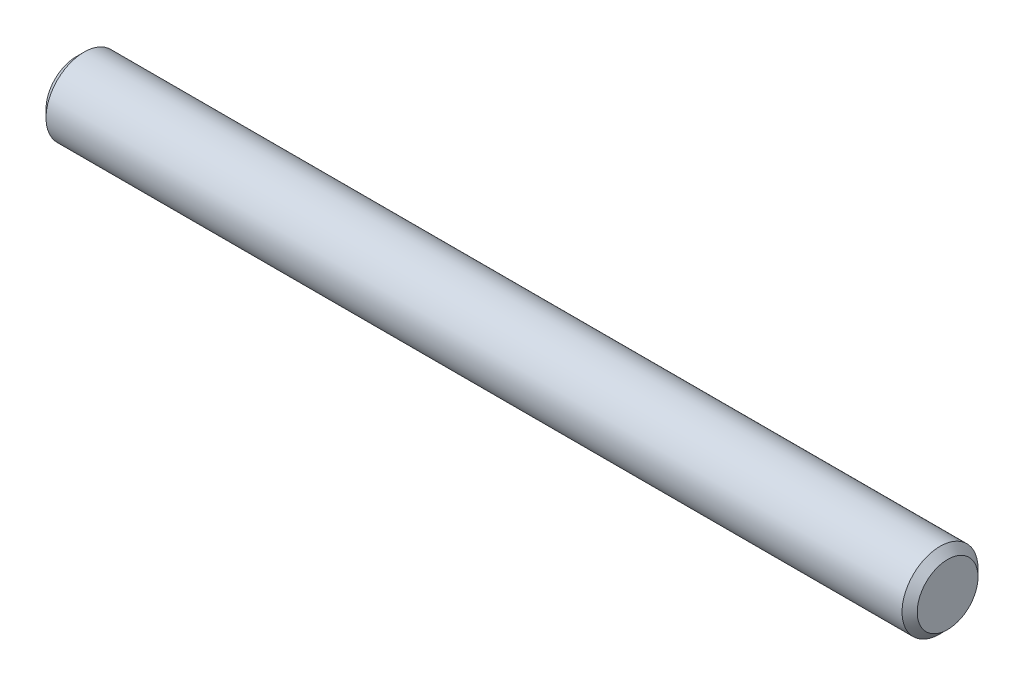
ISO-10303-21;
HEADER;
FILE_DESCRIPTION(('STEP AP214'),'2;1');
FILE_NAME('part.step','',(''),(''),'','','');
FILE_SCHEMA(('AUTOMOTIVE_DESIGN { 1 0 10303 214 1 1 1 1 }'));
ENDSEC;
DATA;
#1=APPLICATION_CONTEXT('core data for automotive mechanical design processes');
#2=APPLICATION_PROTOCOL_DEFINITION('international standard','automotive_design',2000,#1);
#3=PRODUCT_CONTEXT('',#1,'mechanical');
#4=PRODUCT('Part','Part','',(#3));
#5=PRODUCT_RELATED_PRODUCT_CATEGORY('part','',(#4));
#6=PRODUCT_DEFINITION_FORMATION('','',#4);
#7=PRODUCT_DEFINITION_CONTEXT('part definition',#1,'design');
#8=PRODUCT_DEFINITION('design','',#6,#7);
#9=PRODUCT_DEFINITION_SHAPE('','',#8);
#10=(LENGTH_UNIT() NAMED_UNIT(*) SI_UNIT(.MILLI.,.METRE.));
#11=(NAMED_UNIT(*) PLANE_ANGLE_UNIT() SI_UNIT($,.RADIAN.));
#12=(NAMED_UNIT(*) SI_UNIT($,.STERADIAN.) SOLID_ANGLE_UNIT());
#13=UNCERTAINTY_MEASURE_WITH_UNIT(LENGTH_MEASURE(1.E-05),#10,'distance_accuracy_value','');
#14=(GEOMETRIC_REPRESENTATION_CONTEXT(3) GLOBAL_UNCERTAINTY_ASSIGNED_CONTEXT((#13)) GLOBAL_UNIT_ASSIGNED_CONTEXT((#10,
#11,#12)) REPRESENTATION_CONTEXT('',''));
#15=CARTESIAN_POINT('',(0.,0.,0.));
#16=DIRECTION('',(0.,0.,1.));
#17=DIRECTION('',(1.,0.,0.));
#18=AXIS2_PLACEMENT_3D('',#15,#16,#17);
#19=CARTESIAN_POINT('',(-27.305,0.,0.));
#20=DIRECTION('',(1.,0.,0.));
#21=DIRECTION('',(0.,0.,-1.));
#22=AXIS2_PLACEMENT_3D('',#19,#20,#21);
#23=CYLINDRICAL_SURFACE('',#22,2.38125);
#24=CARTESIAN_POINT('',(26.82875,0.,0.));
#25=DIRECTION('',(1.,0.,0.));
#26=DIRECTION('',(0.,0.,-1.));
#27=AXIS2_PLACEMENT_3D('',#24,#25,#26);
#28=CIRCLE('',#27,2.38125);
#29=CARTESIAN_POINT('',(26.82875,0.,-2.38125));
#30=VERTEX_POINT('',#29);
#31=EDGE_CURVE('E45',#30,#30,#28,.F.);
#32=ORIENTED_EDGE('',*,*,#31,.T.);
#33=EDGE_LOOP('',(#32));
#34=FACE_BOUND('',#33,.T.);
#35=CARTESIAN_POINT('',(-26.82875,0.,0.));
#36=DIRECTION('',(1.,0.,0.));
#37=DIRECTION('',(0.,0.,-1.));
#38=AXIS2_PLACEMENT_3D('',#35,#36,#37);
#39=CIRCLE('',#38,2.38125);
#40=CARTESIAN_POINT('',(-26.82875,0.,-2.38125));
#41=VERTEX_POINT('',#40);
#42=EDGE_CURVE('E50',#41,#41,#39,.T.);
#43=ORIENTED_EDGE('',*,*,#42,.T.);
#44=EDGE_LOOP('',(#43));
#45=FACE_BOUND('',#44,.T.);
#46=ADVANCED_FACE('F37',(#34,#45),#23,.T.);
#47=CARTESIAN_POINT('',(-27.305,0.,0.));
#48=DIRECTION('',(1.,0.,0.));
#49=DIRECTION('',(0.,0.,-1.));
#50=AXIS2_PLACEMENT_3D('',#47,#48,#49);
#51=PLANE('',#50);
#52=CARTESIAN_POINT('',(-27.305,0.,0.));
#53=DIRECTION('',(1.,0.,0.));
#54=DIRECTION('',(0.,0.,-1.));
#55=AXIS2_PLACEMENT_3D('',#52,#53,#54);
#56=CIRCLE('',#55,1.905);
#57=CARTESIAN_POINT('',(-27.305,0.,-1.905));
#58=VERTEX_POINT('',#57);
#59=EDGE_CURVE('E10',#58,#58,#56,.F.);
#60=ORIENTED_EDGE('',*,*,#59,.T.);
#61=EDGE_LOOP('',(#60));
#62=FACE_BOUND('',#61,.T.);
#63=ADVANCED_FACE('F72',(#62),#51,.F.);
#64=CARTESIAN_POINT('',(27.305,0.,0.));
#65=DIRECTION('',(1.,0.,0.));
#66=DIRECTION('',(0.,0.,-1.));
#67=AXIS2_PLACEMENT_3D('',#64,#65,#66);
#68=PLANE('',#67);
#69=CARTESIAN_POINT('',(27.305,0.,0.));
#70=DIRECTION('',(1.,0.,0.));
#71=DIRECTION('',(0.,0.,-1.));
#72=AXIS2_PLACEMENT_3D('',#69,#70,#71);
#73=CIRCLE('',#72,1.90500000000001);
#74=CARTESIAN_POINT('',(27.305,0.,-1.90500000000001));
#75=VERTEX_POINT('',#74);
#76=EDGE_CURVE('E55',#75,#75,#73,.T.);
#77=ORIENTED_EDGE('',*,*,#76,.T.);
#78=EDGE_LOOP('',(#77));
#79=FACE_BOUND('',#78,.T.);
#80=ADVANCED_FACE('F62',(#79),#68,.T.);
#81=CARTESIAN_POINT('',(27.305,0.,0.));
#82=DIRECTION('',(-1.,0.,0.));
#83=DIRECTION('',(0.,0.,1.));
#84=AXIS2_PLACEMENT_3D('',#81,#82,#83);
#85=CONICAL_SURFACE('',#84,1.90500000000001,0.78539816339744);
#86=ORIENTED_EDGE('',*,*,#31,.F.);
#87=EDGE_LOOP('',(#86));
#88=FACE_BOUND('',#87,.T.);
#89=ORIENTED_EDGE('',*,*,#76,.F.);
#90=EDGE_LOOP('',(#89));
#91=FACE_BOUND('',#90,.T.);
#92=ADVANCED_FACE('F64',(#88,#91),#85,.T.);
#93=CARTESIAN_POINT('',(-26.82875,0.,0.));
#94=DIRECTION('',(1.,0.,0.));
#95=DIRECTION('',(0.,0.,-1.));
#96=AXIS2_PLACEMENT_3D('',#93,#94,#95);
#97=CONICAL_SURFACE('',#96,2.38125,0.785398163397447);
#98=ORIENTED_EDGE('',*,*,#59,.F.);
#99=EDGE_LOOP('',(#98));
#100=FACE_BOUND('',#99,.T.);
#101=ORIENTED_EDGE('',*,*,#42,.F.);
#102=EDGE_LOOP('',(#101));
#103=FACE_BOUND('',#102,.T.);
#104=ADVANCED_FACE('F39',(#100,#103),#97,.T.);
#105=CLOSED_SHELL('',(#46,#63,#80,#92,#104));
#106=MANIFOLD_SOLID_BREP('B2',#105);
#107=ADVANCED_BREP_SHAPE_REPRESENTATION('',(#18,#106),#14);
#108=SHAPE_DEFINITION_REPRESENTATION(#9,#107);
ENDSEC;
END-ISO-10303-21;
